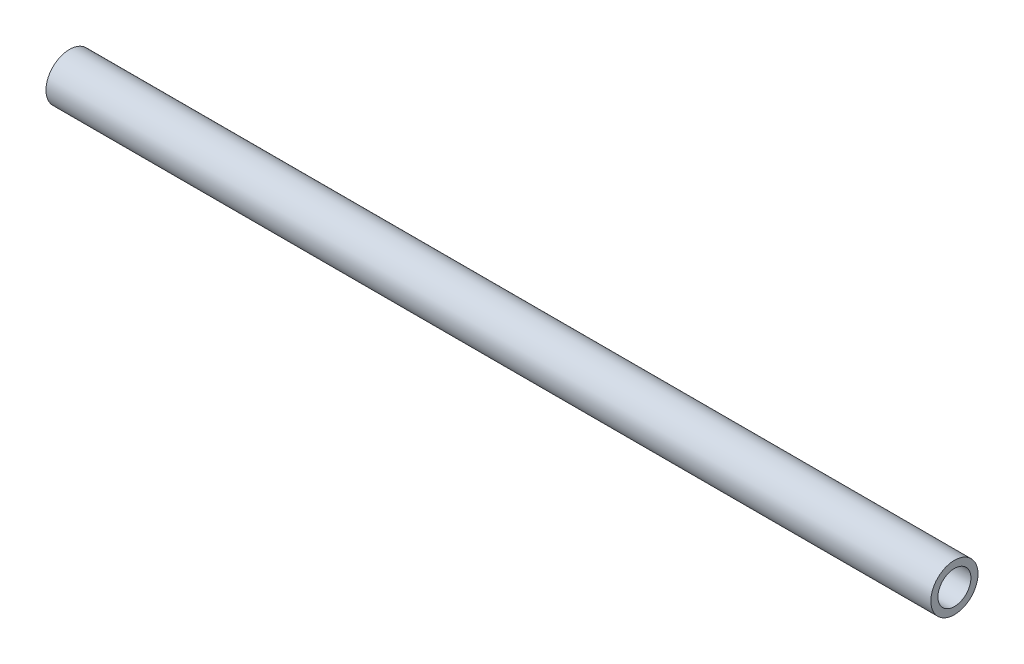
ISO-10303-21;
HEADER;
FILE_DESCRIPTION(('STEP AP214'),'2;1');
FILE_NAME('part.step','',(''),(''),'','','');
FILE_SCHEMA(('AUTOMOTIVE_DESIGN { 1 0 10303 214 1 1 1 1 }'));
ENDSEC;
DATA;
#1=APPLICATION_CONTEXT('core data for automotive mechanical design processes');
#2=APPLICATION_PROTOCOL_DEFINITION('international standard','automotive_design',2000,#1);
#3=PRODUCT_CONTEXT('',#1,'mechanical');
#4=PRODUCT('Part','Part','',(#3));
#5=PRODUCT_RELATED_PRODUCT_CATEGORY('part','',(#4));
#6=PRODUCT_DEFINITION_FORMATION('','',#4);
#7=PRODUCT_DEFINITION_CONTEXT('part definition',#1,'design');
#8=PRODUCT_DEFINITION('design','',#6,#7);
#9=PRODUCT_DEFINITION_SHAPE('','',#8);
#10=(LENGTH_UNIT() NAMED_UNIT(*) SI_UNIT(.MILLI.,.METRE.));
#11=(NAMED_UNIT(*) PLANE_ANGLE_UNIT() SI_UNIT($,.RADIAN.));
#12=(NAMED_UNIT(*) SI_UNIT($,.STERADIAN.) SOLID_ANGLE_UNIT());
#13=UNCERTAINTY_MEASURE_WITH_UNIT(LENGTH_MEASURE(1.E-05),#10,'distance_accuracy_value','');
#14=(GEOMETRIC_REPRESENTATION_CONTEXT(3) GLOBAL_UNCERTAINTY_ASSIGNED_CONTEXT((#13)) GLOBAL_UNIT_ASSIGNED_CONTEXT((#10,
#11,#12)) REPRESENTATION_CONTEXT('',''));
#15=CARTESIAN_POINT('',(0.,0.,0.));
#16=DIRECTION('',(0.,0.,1.));
#17=DIRECTION('',(1.,0.,0.));
#18=AXIS2_PLACEMENT_3D('',#15,#16,#17);
#19=CARTESIAN_POINT('',(0.,0.,0.));
#20=DIRECTION('',(1.,0.,0.));
#21=DIRECTION('',(0.,0.,-1.));
#22=AXIS2_PLACEMENT_3D('',#19,#20,#21);
#23=PLANE('',#22);
#24=CARTESIAN_POINT('',(0.,0.,0.));
#25=DIRECTION('',(1.,0.,0.));
#26=DIRECTION('',(0.,0.,-1.));
#27=AXIS2_PLACEMENT_3D('',#24,#25,#26);
#28=CIRCLE('',#27,7.);
#29=CARTESIAN_POINT('',(0.,0.,-7.));
#30=VERTEX_POINT('',#29);
#31=EDGE_CURVE('E57',#30,#30,#28,.T.);
#32=ORIENTED_EDGE('',*,*,#31,.T.);
#33=EDGE_LOOP('',(#32));
#34=FACE_BOUND('',#33,.T.);
#35=CARTESIAN_POINT('',(0.,0.,0.));
#36=DIRECTION('',(1.,0.,0.));
#37=DIRECTION('',(0.,0.,-1.));
#38=AXIS2_PLACEMENT_3D('',#35,#36,#37);
#39=CIRCLE('',#38,10.);
#40=CARTESIAN_POINT('',(0.,0.,-10.));
#41=VERTEX_POINT('',#40);
#42=EDGE_CURVE('E46',#41,#41,#39,.T.);
#43=ORIENTED_EDGE('',*,*,#42,.F.);
#44=EDGE_LOOP('',(#43));
#45=FACE_BOUND('',#44,.T.);
#46=ADVANCED_FACE('F42',(#34,#45),#23,.F.);
#47=CARTESIAN_POINT('',(375.5,0.,0.));
#48=DIRECTION('',(1.,0.,0.));
#49=DIRECTION('',(0.,0.,-1.));
#50=AXIS2_PLACEMENT_3D('',#47,#48,#49);
#51=PLANE('',#50);
#52=CARTESIAN_POINT('',(375.5,0.,0.));
#53=DIRECTION('',(1.,0.,0.));
#54=DIRECTION('',(0.,0.,-1.));
#55=AXIS2_PLACEMENT_3D('',#52,#53,#54);
#56=CIRCLE('',#55,7.);
#57=CARTESIAN_POINT('',(375.5,0.,-7.));
#58=VERTEX_POINT('',#57);
#59=EDGE_CURVE('E53',#58,#58,#56,.T.);
#60=ORIENTED_EDGE('',*,*,#59,.F.);
#61=EDGE_LOOP('',(#60));
#62=FACE_BOUND('',#61,.T.);
#63=CARTESIAN_POINT('',(375.5,0.,0.));
#64=DIRECTION('',(1.,0.,0.));
#65=DIRECTION('',(0.,0.,-1.));
#66=AXIS2_PLACEMENT_3D('',#63,#64,#65);
#67=CIRCLE('',#66,10.);
#68=CARTESIAN_POINT('',(375.5,0.,-10.));
#69=VERTEX_POINT('',#68);
#70=EDGE_CURVE('E11',#69,#69,#67,.T.);
#71=ORIENTED_EDGE('',*,*,#70,.T.);
#72=EDGE_LOOP('',(#71));
#73=FACE_BOUND('',#72,.T.);
#74=ADVANCED_FACE('F70',(#62,#73),#51,.T.);
#75=CARTESIAN_POINT('',(0.,0.,0.));
#76=DIRECTION('',(1.,0.,0.));
#77=DIRECTION('',(0.,0.,-1.));
#78=AXIS2_PLACEMENT_3D('',#75,#76,#77);
#79=CYLINDRICAL_SURFACE('',#78,10.);
#80=ORIENTED_EDGE('',*,*,#70,.F.);
#81=EDGE_LOOP('',(#80));
#82=FACE_BOUND('',#81,.T.);
#83=ORIENTED_EDGE('',*,*,#42,.T.);
#84=EDGE_LOOP('',(#83));
#85=FACE_BOUND('',#84,.T.);
#86=ADVANCED_FACE('F44',(#82,#85),#79,.T.);
#87=CARTESIAN_POINT('',(0.,0.,0.));
#88=DIRECTION('',(1.,0.,0.));
#89=DIRECTION('',(0.,0.,-1.));
#90=AXIS2_PLACEMENT_3D('',#87,#88,#89);
#91=CYLINDRICAL_SURFACE('',#90,7.);
#92=ORIENTED_EDGE('',*,*,#59,.T.);
#93=EDGE_LOOP('',(#92));
#94=FACE_BOUND('',#93,.T.);
#95=ORIENTED_EDGE('',*,*,#31,.F.);
#96=EDGE_LOOP('',(#95));
#97=FACE_BOUND('',#96,.T.);
#98=ADVANCED_FACE('F63',(#94,#97),#91,.F.);
#99=CLOSED_SHELL('',(#46,#74,#86,#98));
#100=MANIFOLD_SOLID_BREP('B2',#99);
#101=ADVANCED_BREP_SHAPE_REPRESENTATION('',(#18,#100),#14);
#102=SHAPE_DEFINITION_REPRESENTATION(#9,#101);
ENDSEC;
END-ISO-10303-21;
